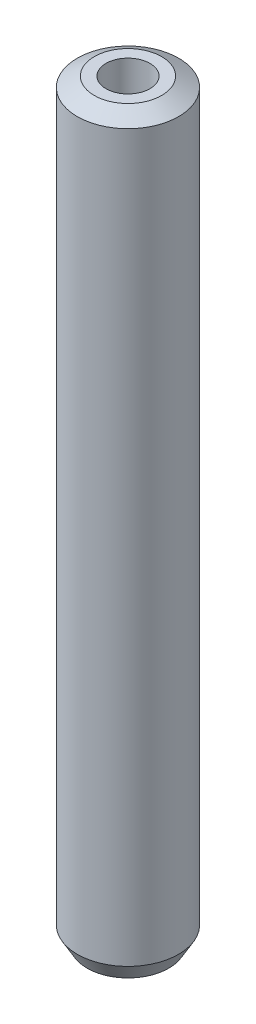
ISO-10303-21;
HEADER;
FILE_DESCRIPTION(('STEP AP214'),'2;1');
FILE_NAME('part.step','',(''),(''),'','','');
FILE_SCHEMA(('AUTOMOTIVE_DESIGN { 1 0 10303 214 1 1 1 1 }'));
ENDSEC;
DATA;
#1=APPLICATION_CONTEXT('core data for automotive mechanical design processes');
#2=APPLICATION_PROTOCOL_DEFINITION('international standard','automotive_design',2000,#1);
#3=PRODUCT_CONTEXT('',#1,'mechanical');
#4=PRODUCT('Part','Part','',(#3));
#5=PRODUCT_RELATED_PRODUCT_CATEGORY('part','',(#4));
#6=PRODUCT_DEFINITION_FORMATION('','',#4);
#7=PRODUCT_DEFINITION_CONTEXT('part definition',#1,'design');
#8=PRODUCT_DEFINITION('design','',#6,#7);
#9=PRODUCT_DEFINITION_SHAPE('','',#8);
#10=(LENGTH_UNIT() NAMED_UNIT(*) SI_UNIT(.MILLI.,.METRE.));
#11=(NAMED_UNIT(*) PLANE_ANGLE_UNIT() SI_UNIT($,.RADIAN.));
#12=(NAMED_UNIT(*) SI_UNIT($,.STERADIAN.) SOLID_ANGLE_UNIT());
#13=UNCERTAINTY_MEASURE_WITH_UNIT(LENGTH_MEASURE(1.E-05),#10,'distance_accuracy_value','');
#14=(GEOMETRIC_REPRESENTATION_CONTEXT(3) GLOBAL_UNCERTAINTY_ASSIGNED_CONTEXT((#13)) GLOBAL_UNIT_ASSIGNED_CONTEXT((#10,
#11,#12)) REPRESENTATION_CONTEXT('',''));
#15=CARTESIAN_POINT('',(0.,0.,0.));
#16=DIRECTION('',(0.,0.,1.));
#17=DIRECTION('',(1.,0.,0.));
#18=AXIS2_PLACEMENT_3D('',#15,#16,#17);
#19=CARTESIAN_POINT('',(0.,74.2343136816131,0.));
#20=DIRECTION('',(0.,-1.,0.));
#21=DIRECTION('',(0.,0.,-1.));
#22=AXIS2_PLACEMENT_3D('',#19,#20,#21);
#23=CYLINDRICAL_SURFACE('',#22,5.);
#24=CARTESIAN_POINT('',(0.,73.2667849633232,0.));
#25=DIRECTION('',(0.,1.,0.));
#26=DIRECTION('',(0.,0.,1.));
#27=AXIS2_PLACEMENT_3D('',#24,#25,#26);
#28=CIRCLE('',#27,5.);
#29=CARTESIAN_POINT('',(0.,73.2667849633232,5.));
#30=VERTEX_POINT('',#29);
#31=EDGE_CURVE('E50',#30,#30,#28,.F.);
#32=ORIENTED_EDGE('',*,*,#31,.T.);
#33=EDGE_LOOP('',(#32));
#34=FACE_BOUND('',#33,.T.);
#35=CARTESIAN_POINT('',(0.,1.67580889786012,0.));
#36=DIRECTION('',(0.,1.,0.));
#37=DIRECTION('',(0.,0.,1.));
#38=AXIS2_PLACEMENT_3D('',#35,#36,#37);
#39=CIRCLE('',#38,5.);
#40=CARTESIAN_POINT('',(0.,1.67580889786012,5.));
#41=VERTEX_POINT('',#40);
#42=EDGE_CURVE('E51',#41,#41,#39,.T.);
#43=ORIENTED_EDGE('',*,*,#42,.T.);
#44=EDGE_LOOP('',(#43));
#45=FACE_BOUND('',#44,.T.);
#46=ADVANCED_FACE('F39',(#34,#45),#23,.T.);
#47=CARTESIAN_POINT('',(0.,74.2343136816131,0.));
#48=DIRECTION('',(0.,1.,0.));
#49=DIRECTION('',(0.,0.,1.));
#50=AXIS2_PLACEMENT_3D('',#47,#48,#49);
#51=PLANE('',#50);
#52=CARTESIAN_POINT('',(0.,74.2343136816131,0.));
#53=DIRECTION('',(0.,1.,0.));
#54=DIRECTION('',(0.,0.,1.));
#55=AXIS2_PLACEMENT_3D('',#52,#53,#54);
#56=CIRCLE('',#55,3.32419110213988);
#57=CARTESIAN_POINT('',(0.,74.2343136816131,3.32419110213988));
#58=VERTEX_POINT('',#57);
#59=EDGE_CURVE('E54',#58,#58,#56,.T.);
#60=ORIENTED_EDGE('',*,*,#59,.T.);
#61=EDGE_LOOP('',(#60));
#62=FACE_BOUND('',#61,.T.);
#63=CARTESIAN_POINT('',(0.,74.2343136816131,0.));
#64=DIRECTION('',(0.,1.,0.));
#65=DIRECTION('',(0.,0.,1.));
#66=AXIS2_PLACEMENT_3D('',#63,#64,#65);
#67=CIRCLE('',#66,2.16822271766512);
#68=CARTESIAN_POINT('',(0.,74.2343136816131,2.16822271766512));
#69=VERTEX_POINT('',#68);
#70=EDGE_CURVE('E58',#69,#69,#67,.T.);
#71=ORIENTED_EDGE('',*,*,#70,.F.);
#72=EDGE_LOOP('',(#71));
#73=FACE_BOUND('',#72,.T.);
#74=ADVANCED_FACE('F69',(#62,#73),#51,.T.);
#75=CARTESIAN_POINT('',(0.,0.,0.));
#76=DIRECTION('',(0.,1.,0.));
#77=DIRECTION('',(0.,0.,1.));
#78=AXIS2_PLACEMENT_3D('',#75,#76,#77);
#79=PLANE('',#78);
#80=CARTESIAN_POINT('',(0.,0.,0.));
#81=DIRECTION('',(0.,1.,0.));
#82=DIRECTION('',(0.,0.,1.));
#83=AXIS2_PLACEMENT_3D('',#80,#81,#82);
#84=CIRCLE('',#83,4.03247128171008);
#85=CARTESIAN_POINT('',(0.,0.,4.03247128171008));
#86=VERTEX_POINT('',#85);
#87=EDGE_CURVE('E10',#86,#86,#84,.F.);
#88=ORIENTED_EDGE('',*,*,#87,.T.);
#89=EDGE_LOOP('',(#88));
#90=FACE_BOUND('',#89,.T.);
#91=CARTESIAN_POINT('',(0.,0.,0.));
#92=DIRECTION('',(0.,1.,0.));
#93=DIRECTION('',(0.,0.,1.));
#94=AXIS2_PLACEMENT_3D('',#91,#92,#93);
#95=CIRCLE('',#94,2.16822271766512);
#96=CARTESIAN_POINT('',(0.,0.,2.16822271766512));
#97=VERTEX_POINT('',#96);
#98=EDGE_CURVE('E63',#97,#97,#95,.T.);
#99=ORIENTED_EDGE('',*,*,#98,.T.);
#100=EDGE_LOOP('',(#99));
#101=FACE_BOUND('',#100,.T.);
#102=ADVANCED_FACE('F75',(#90,#101),#79,.F.);
#103=CARTESIAN_POINT('',(0.,74.2343136816131,0.));
#104=DIRECTION('',(0.,-1.,0.));
#105=DIRECTION('',(0.,0.,-1.));
#106=AXIS2_PLACEMENT_3D('',#103,#104,#105);
#107=CYLINDRICAL_SURFACE('',#106,2.16822271766512);
#108=ORIENTED_EDGE('',*,*,#70,.T.);
#109=EDGE_LOOP('',(#108));
#110=FACE_BOUND('',#109,.T.);
#111=ORIENTED_EDGE('',*,*,#98,.F.);
#112=EDGE_LOOP('',(#111));
#113=FACE_BOUND('',#112,.T.);
#114=ADVANCED_FACE('F70',(#110,#113),#107,.F.);
#115=CARTESIAN_POINT('',(0.,74.2343136816131,0.));
#116=DIRECTION('',(0.,-1.,0.));
#117=DIRECTION('',(0.,0.,-1.));
#118=AXIS2_PLACEMENT_3D('',#115,#116,#117);
#119=CONICAL_SURFACE('',#118,3.32419110213988,1.04719755119659);
#120=ORIENTED_EDGE('',*,*,#31,.F.);
#121=EDGE_LOOP('',(#120));
#122=FACE_BOUND('',#121,.T.);
#123=ORIENTED_EDGE('',*,*,#59,.F.);
#124=EDGE_LOOP('',(#123));
#125=FACE_BOUND('',#124,.T.);
#126=ADVANCED_FACE('F81',(#122,#125),#119,.T.);
#127=CARTESIAN_POINT('',(0.,1.67580889786012,0.));
#128=DIRECTION('',(0.,1.,0.));
#129=DIRECTION('',(0.,0.,1.));
#130=AXIS2_PLACEMENT_3D('',#127,#128,#129);
#131=CONICAL_SURFACE('',#130,5.,0.523598775598302);
#132=ORIENTED_EDGE('',*,*,#87,.F.);
#133=EDGE_LOOP('',(#132));
#134=FACE_BOUND('',#133,.T.);
#135=ORIENTED_EDGE('',*,*,#42,.F.);
#136=EDGE_LOOP('',(#135));
#137=FACE_BOUND('',#136,.T.);
#138=ADVANCED_FACE('F45',(#134,#137),#131,.T.);
#139=CLOSED_SHELL('',(#46,#74,#102,#114,#126,#138));
#140=MANIFOLD_SOLID_BREP('B2',#139);
#141=ADVANCED_BREP_SHAPE_REPRESENTATION('',(#18,#140),#14);
#142=SHAPE_DEFINITION_REPRESENTATION(#9,#141);
ENDSEC;
END-ISO-10303-21;
